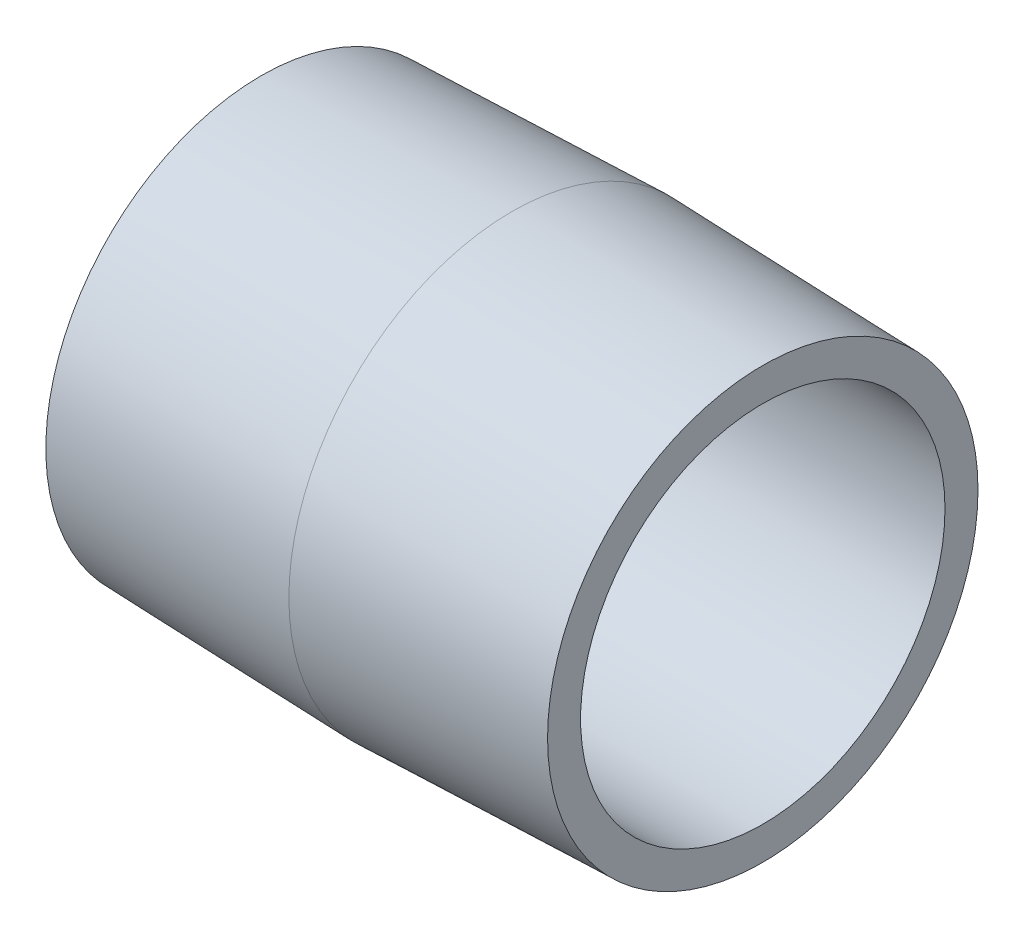
ISO-10303-21;
HEADER;
FILE_DESCRIPTION(('STEP AP214'),'2;1');
FILE_NAME('part.step','',(''),(''),'','','');
FILE_SCHEMA(('AUTOMOTIVE_DESIGN { 1 0 10303 214 1 1 1 1 }'));
ENDSEC;
DATA;
#1=APPLICATION_CONTEXT('core data for automotive mechanical design processes');
#2=APPLICATION_PROTOCOL_DEFINITION('international standard','automotive_design',2000,#1);
#3=PRODUCT_CONTEXT('',#1,'mechanical');
#4=PRODUCT('Part','Part','',(#3));
#5=PRODUCT_RELATED_PRODUCT_CATEGORY('part','',(#4));
#6=PRODUCT_DEFINITION_FORMATION('','',#4);
#7=PRODUCT_DEFINITION_CONTEXT('part definition',#1,'design');
#8=PRODUCT_DEFINITION('design','',#6,#7);
#9=PRODUCT_DEFINITION_SHAPE('','',#8);
#10=(LENGTH_UNIT() NAMED_UNIT(*) SI_UNIT(.MILLI.,.METRE.));
#11=(NAMED_UNIT(*) PLANE_ANGLE_UNIT() SI_UNIT($,.RADIAN.));
#12=(NAMED_UNIT(*) SI_UNIT($,.STERADIAN.) SOLID_ANGLE_UNIT());
#13=UNCERTAINTY_MEASURE_WITH_UNIT(LENGTH_MEASURE(1.E-05),#10,'distance_accuracy_value','');
#14=(GEOMETRIC_REPRESENTATION_CONTEXT(3) GLOBAL_UNCERTAINTY_ASSIGNED_CONTEXT((#13)) GLOBAL_UNIT_ASSIGNED_CONTEXT((#10,
#11,#12)) REPRESENTATION_CONTEXT('',''));
#15=CARTESIAN_POINT('',(0.,0.,0.));
#16=DIRECTION('',(0.,0.,1.));
#17=DIRECTION('',(1.,0.,0.));
#18=AXIS2_PLACEMENT_3D('',#15,#16,#17);
#19=CARTESIAN_POINT('',(0.,0.,0.));
#20=DIRECTION('',(1.,0.,0.));
#21=DIRECTION('',(0.,0.,-1.));
#22=AXIS2_PLACEMENT_3D('',#19,#20,#21);
#23=CYLINDRICAL_SURFACE('',#22,13.8);
#24=CARTESIAN_POINT('',(0.,0.,0.));
#25=DIRECTION('',(1.,0.,0.));
#26=DIRECTION('',(0.,0.,-1.));
#27=AXIS2_PLACEMENT_3D('',#24,#25,#26);
#28=CIRCLE('',#27,13.8);
#29=CARTESIAN_POINT('',(0.,0.,-13.8));
#30=VERTEX_POINT('',#29);
#31=EDGE_CURVE('E18',#30,#30,#28,.T.);
#32=ORIENTED_EDGE('',*,*,#31,.F.);
#33=EDGE_LOOP('',(#32));
#34=FACE_BOUND('',#33,.T.);
#35=CARTESIAN_POINT('',(37.9999999999999,0.,0.));
#36=DIRECTION('',(1.,0.,0.));
#37=DIRECTION('',(0.,0.,-1.));
#38=AXIS2_PLACEMENT_3D('',#35,#36,#37);
#39=CIRCLE('',#38,13.8);
#40=CARTESIAN_POINT('',(37.9999999999999,0.,-13.8));
#41=VERTEX_POINT('',#40);
#42=EDGE_CURVE('E31',#41,#41,#39,.F.);
#43=ORIENTED_EDGE('',*,*,#42,.F.);
#44=EDGE_LOOP('',(#43));
#45=FACE_BOUND('',#44,.T.);
#46=ADVANCED_FACE('F15',(#34,#45),#23,.F.);
#47=CARTESIAN_POINT('',(0.,15.04990625,0.));
#48=DIRECTION('',(-1.,0.,0.));
#49=DIRECTION('',(0.,0.,1.));
#50=AXIS2_PLACEMENT_3D('',#47,#48,#49);
#51=PLANE('',#50);
#52=ORIENTED_EDGE('',*,*,#31,.T.);
#53=EDGE_LOOP('',(#52));
#54=FACE_BOUND('',#53,.T.);
#55=CARTESIAN_POINT('',(-1.58207779051783E-10,0.,0.));
#56=DIRECTION('',(1.,0.,0.));
#57=DIRECTION('',(0.,1.,0.));
#58=AXIS2_PLACEMENT_3D('',#55,#56,#57);
#59=CIRCLE('',#58,16.2998125050625);
#60=CARTESIAN_POINT('',(-1.58208777094481E-10,16.2998125050625,0.));
#61=VERTEX_POINT('',#60);
#62=EDGE_CURVE('E27',#61,#61,#59,.T.);
#63=ORIENTED_EDGE('',*,*,#62,.F.);
#64=EDGE_LOOP('',(#63));
#65=FACE_BOUND('',#64,.T.);
#66=ADVANCED_FACE('F38',(#54,#65),#51,.T.);
#67=CARTESIAN_POINT('',(37.9999999999999,15.04990625,0.));
#68=DIRECTION('',(1.,0.,0.));
#69=DIRECTION('',(0.,0.,-1.));
#70=AXIS2_PLACEMENT_3D('',#67,#68,#69);
#71=PLANE('',#70);
#72=ORIENTED_EDGE('',*,*,#42,.T.);
#73=EDGE_LOOP('',(#72));
#74=FACE_BOUND('',#73,.T.);
#75=CARTESIAN_POINT('',(38.0000000001581,0.,0.));
#76=DIRECTION('',(-1.,0.,0.));
#77=DIRECTION('',(0.,0.,1.));
#78=AXIS2_PLACEMENT_3D('',#75,#76,#77);
#79=CIRCLE('',#78,16.2998125050625);
#80=CARTESIAN_POINT('',(38.0000000001581,0.,16.2998125050625));
#81=VERTEX_POINT('',#80);
#82=EDGE_CURVE('E22',#81,#81,#79,.T.);
#83=ORIENTED_EDGE('',*,*,#82,.F.);
#84=EDGE_LOOP('',(#83));
#85=FACE_BOUND('',#84,.T.);
#86=ADVANCED_FACE('F47',(#74,#85),#71,.T.);
#87=CARTESIAN_POINT('',(-1.58094760663924E-10,0.,0.));
#88=DIRECTION('',(1.,0.,0.));
#89=DIRECTION('',(0.,1.,0.));
#90=AXIS2_PLACEMENT_3D('',#87,#88,#89);
#91=CONICAL_SURFACE('',#90,16.2998125050625,0.0312398328973749);
#92=CARTESIAN_POINT('',(18.9999999998418,0.,0.));
#93=DIRECTION('',(-1.,0.,0.));
#94=DIRECTION('',(0.,1.,0.));
#95=AXIS2_PLACEMENT_3D('',#92,#93,#94);
#96=CIRCLE('',#95,16.8935624949375);
#97=CARTESIAN_POINT('',(18.9999999998418,16.8935624949375,0.));
#98=VERTEX_POINT('',#97);
#99=EDGE_CURVE('E10',#98,#98,#96,.F.);
#100=ORIENTED_EDGE('',*,*,#99,.F.);
#101=EDGE_LOOP('',(#100));
#102=FACE_BOUND('',#101,.T.);
#103=ORIENTED_EDGE('',*,*,#62,.T.);
#104=EDGE_LOOP('',(#103));
#105=FACE_BOUND('',#104,.T.);
#106=ADVANCED_FACE('F50',(#102,#105),#91,.T.);
#107=CARTESIAN_POINT('',(38.000000000158,0.,0.));
#108=DIRECTION('',(-1.,0.,0.));
#109=DIRECTION('',(0.,0.,1.));
#110=AXIS2_PLACEMENT_3D('',#107,#108,#109);
#111=CONICAL_SURFACE('',#110,16.2998125050625,0.0312398328973751);
#112=ORIENTED_EDGE('',*,*,#82,.T.);
#113=EDGE_LOOP('',(#112));
#114=FACE_BOUND('',#113,.T.);
#115=ORIENTED_EDGE('',*,*,#99,.T.);
#116=EDGE_LOOP('',(#115));
#117=FACE_BOUND('',#116,.T.);
#118=ADVANCED_FACE('F48',(#114,#117),#111,.T.);
#119=CLOSED_SHELL('',(#46,#66,#86,#106,#118));
#120=MANIFOLD_SOLID_BREP('B1',#119);
#121=ADVANCED_BREP_SHAPE_REPRESENTATION('',(#18,#120),#14);
#122=SHAPE_DEFINITION_REPRESENTATION(#9,#121);
ENDSEC;
END-ISO-10303-21;
